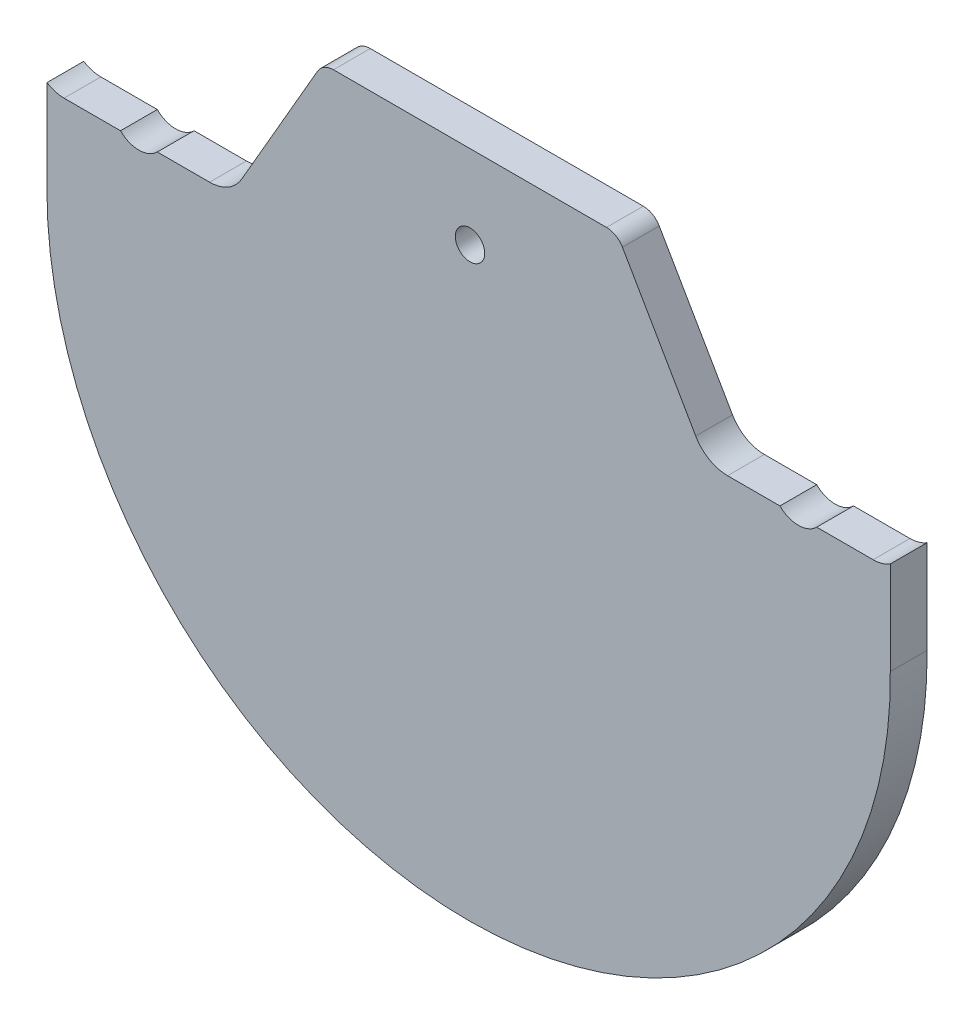
ISO-10303-21;
HEADER;
FILE_DESCRIPTION(('STEP AP214'),'2;1');
FILE_NAME('part.step','',(''),(''),'','','');
FILE_SCHEMA(('AUTOMOTIVE_DESIGN { 1 0 10303 214 1 1 1 1 }'));
ENDSEC;
DATA;
#1=APPLICATION_CONTEXT('core data for automotive mechanical design processes');
#2=APPLICATION_PROTOCOL_DEFINITION('international standard','automotive_design',2000,#1);
#3=PRODUCT_CONTEXT('',#1,'mechanical');
#4=PRODUCT('Part','Part','',(#3));
#5=PRODUCT_RELATED_PRODUCT_CATEGORY('part','',(#4));
#6=PRODUCT_DEFINITION_FORMATION('','',#4);
#7=PRODUCT_DEFINITION_CONTEXT('part definition',#1,'design');
#8=PRODUCT_DEFINITION('design','',#6,#7);
#9=PRODUCT_DEFINITION_SHAPE('','',#8);
#10=(LENGTH_UNIT() NAMED_UNIT(*) SI_UNIT(.MILLI.,.METRE.));
#11=(NAMED_UNIT(*) PLANE_ANGLE_UNIT() SI_UNIT($,.RADIAN.));
#12=(NAMED_UNIT(*) SI_UNIT($,.STERADIAN.) SOLID_ANGLE_UNIT());
#13=UNCERTAINTY_MEASURE_WITH_UNIT(LENGTH_MEASURE(1.E-05),#10,'distance_accuracy_value','');
#14=(GEOMETRIC_REPRESENTATION_CONTEXT(3) GLOBAL_UNCERTAINTY_ASSIGNED_CONTEXT((#13)) GLOBAL_UNIT_ASSIGNED_CONTEXT((#10,
#11,#12)) REPRESENTATION_CONTEXT('',''));
#15=CARTESIAN_POINT('',(0.,0.,0.));
#16=DIRECTION('',(0.,0.,1.));
#17=DIRECTION('',(1.,0.,0.));
#18=AXIS2_PLACEMENT_3D('',#15,#16,#17);
#19=CARTESIAN_POINT('',(38.5566243270259,-2.5,5.));
#20=DIRECTION('',(0.,0.,-1.));
#21=DIRECTION('',(-1.,0.,0.));
#22=AXIS2_PLACEMENT_3D('',#19,#20,#21);
#23=CYLINDRICAL_SURFACE('',#22,2.5);
#24=CARTESIAN_POINT('',(38.5566243270259,-2.5,0.));
#25=DIRECTION('',(0.,0.,1.));
#26=DIRECTION('',(1.,0.,0.));
#27=AXIS2_PLACEMENT_3D('',#24,#25,#26);
#28=CIRCLE('',#27,2.5);
#29=CARTESIAN_POINT('',(40.721687836487,-1.24999999999999,0.));
#30=VERTEX_POINT('',#29);
#31=CARTESIAN_POINT('',(38.5566243270259,0.,0.));
#32=VERTEX_POINT('',#31);
#33=EDGE_CURVE('E189',#30,#32,#28,.T.);
#34=ORIENTED_EDGE('',*,*,#33,.T.);
#35=DIRECTION('',(0.,0.,-1.));
#36=VECTOR('',#35,1.);
#37=CARTESIAN_POINT('',(38.5566243270259,0.,5.));
#38=LINE('',#37,#36);
#39=CARTESIAN_POINT('',(38.5566243270259,0.,5.));
#40=VERTEX_POINT('',#39);
#41=EDGE_CURVE('E11',#40,#32,#38,.T.);
#42=ORIENTED_EDGE('',*,*,#41,.F.);
#43=CARTESIAN_POINT('',(38.5566243270259,-2.5,5.));
#44=DIRECTION('',(0.,0.,1.));
#45=DIRECTION('',(1.,0.,0.));
#46=AXIS2_PLACEMENT_3D('',#43,#44,#45);
#47=CIRCLE('',#46,2.5);
#48=CARTESIAN_POINT('',(40.721687836487,-1.24999999999999,5.));
#49=VERTEX_POINT('',#48);
#50=EDGE_CURVE('E224',#49,#40,#47,.T.);
#51=ORIENTED_EDGE('',*,*,#50,.F.);
#52=DIRECTION('',(0.,0.,-1.));
#53=VECTOR('',#52,1.);
#54=CARTESIAN_POINT('',(40.721687836487,-1.24999999999999,5.));
#55=LINE('',#54,#53);
#56=EDGE_CURVE('E185',#49,#30,#55,.T.);
#57=ORIENTED_EDGE('',*,*,#56,.T.);
#58=EDGE_LOOP('',(#34,#42,#51,#57));
#59=FACE_BOUND('',#58,.T.);
#60=ADVANCED_FACE('F33',(#59),#23,.T.);
#61=CARTESIAN_POINT('',(1.44337567297407,0.,5.));
#62=DIRECTION('',(0.,-1.,0.));
#63=DIRECTION('',(0.,0.,-1.));
#64=AXIS2_PLACEMENT_3D('',#61,#62,#63);
#65=PLANE('',#64);
#66=DIRECTION('',(-1.,0.,0.));
#67=VECTOR('',#66,1.);
#68=CARTESIAN_POINT('',(1.44337567297407,0.,0.));
#69=LINE('',#68,#67);
#70=CARTESIAN_POINT('',(1.44337567297407,0.,0.));
#71=VERTEX_POINT('',#70);
#72=EDGE_CURVE('E192',#32,#71,#69,.T.);
#73=ORIENTED_EDGE('',*,*,#72,.T.);
#74=DIRECTION('',(0.,0.,-1.));
#75=VECTOR('',#74,1.);
#76=CARTESIAN_POINT('',(1.44337567297407,0.,5.));
#77=LINE('',#76,#75);
#78=CARTESIAN_POINT('',(1.44337567297407,0.,5.));
#79=VERTEX_POINT('',#78);
#80=EDGE_CURVE('E41',#79,#71,#77,.T.);
#81=ORIENTED_EDGE('',*,*,#80,.F.);
#82=DIRECTION('',(-1.,0.,0.));
#83=VECTOR('',#82,1.);
#84=CARTESIAN_POINT('',(1.44337567297407,0.,5.));
#85=LINE('',#84,#83);
#86=EDGE_CURVE('E122',#40,#79,#85,.T.);
#87=ORIENTED_EDGE('',*,*,#86,.F.);
#88=ORIENTED_EDGE('',*,*,#41,.T.);
#89=EDGE_LOOP('',(#73,#81,#87,#88));
#90=FACE_BOUND('',#89,.T.);
#91=ADVANCED_FACE('F333',(#90),#65,.F.);
#92=CARTESIAN_POINT('',(1.44337567297406,-2.5,5.));
#93=DIRECTION('',(0.,0.,-1.));
#94=DIRECTION('',(-1.,0.,0.));
#95=AXIS2_PLACEMENT_3D('',#92,#93,#94);
#96=CYLINDRICAL_SURFACE('',#95,2.5);
#97=CARTESIAN_POINT('',(1.44337567297406,-2.5,0.));
#98=DIRECTION('',(0.,0.,1.));
#99=DIRECTION('',(-1.,0.,0.));
#100=AXIS2_PLACEMENT_3D('',#97,#98,#99);
#101=CIRCLE('',#100,2.5);
#102=CARTESIAN_POINT('',(-0.721687836487038,-1.25000000000001,0.));
#103=VERTEX_POINT('',#102);
#104=EDGE_CURVE('E195',#71,#103,#101,.T.);
#105=ORIENTED_EDGE('',*,*,#104,.T.);
#106=DIRECTION('',(0.,0.,-1.));
#107=VECTOR('',#106,1.);
#108=CARTESIAN_POINT('',(-0.721687836487038,-1.25000000000001,5.));
#109=LINE('',#108,#107);
#110=CARTESIAN_POINT('',(-0.721687836487038,-1.25000000000001,5.));
#111=VERTEX_POINT('',#110);
#112=EDGE_CURVE('E261',#111,#103,#109,.T.);
#113=ORIENTED_EDGE('',*,*,#112,.F.);
#114=CARTESIAN_POINT('',(1.44337567297406,-2.5,5.));
#115=DIRECTION('',(0.,0.,1.));
#116=DIRECTION('',(-1.,0.,0.));
#117=AXIS2_PLACEMENT_3D('',#114,#115,#116);
#118=CIRCLE('',#117,2.5);
#119=EDGE_CURVE('E269',#79,#111,#118,.T.);
#120=ORIENTED_EDGE('',*,*,#119,.F.);
#121=ORIENTED_EDGE('',*,*,#80,.T.);
#122=EDGE_LOOP('',(#105,#113,#120,#121));
#123=FACE_BOUND('',#122,.T.);
#124=ADVANCED_FACE('F267',(#123),#96,.T.);
#125=CARTESIAN_POINT('',(-0.721687836487038,-1.25000000000001,5.));
#126=DIRECTION('',(0.866025403784438,-0.500000000000001,0.));
#127=DIRECTION('',(0.500000000000001,0.866025403784438,0.));
#128=AXIS2_PLACEMENT_3D('',#125,#126,#127);
#129=PLANE('',#128);
#130=DIRECTION('',(-0.500000000000001,-0.866025403784438,0.));
#131=VECTOR('',#130,1.);
#132=CARTESIAN_POINT('',(-0.721687836487038,-1.25000000000001,0.));
#133=LINE('',#132,#131);
#134=CARTESIAN_POINT('',(-11.0566243270259,-19.1506350946109,0.));
#135=VERTEX_POINT('',#134);
#136=EDGE_CURVE('E197',#103,#135,#133,.T.);
#137=ORIENTED_EDGE('',*,*,#136,.T.);
#138=DIRECTION('',(0.,0.,-1.));
#139=VECTOR('',#138,1.);
#140=CARTESIAN_POINT('',(-11.0566243270259,-19.1506350946109,5.));
#141=LINE('',#140,#139);
#142=CARTESIAN_POINT('',(-11.0566243270259,-19.1506350946109,5.));
#143=VERTEX_POINT('',#142);
#144=EDGE_CURVE('E258',#143,#135,#141,.T.);
#145=ORIENTED_EDGE('',*,*,#144,.F.);
#146=DIRECTION('',(-0.500000000000001,-0.866025403784438,0.));
#147=VECTOR('',#146,1.);
#148=CARTESIAN_POINT('',(-0.721687836487038,-1.25000000000001,5.));
#149=LINE('',#148,#147);
#150=EDGE_CURVE('E287',#111,#143,#149,.T.);
#151=ORIENTED_EDGE('',*,*,#150,.F.);
#152=ORIENTED_EDGE('',*,*,#112,.T.);
#153=EDGE_LOOP('',(#137,#145,#151,#152));
#154=FACE_BOUND('',#153,.T.);
#155=ADVANCED_FACE('F278',(#154),#129,.F.);
#156=CARTESIAN_POINT('',(-15.3867513459481,-16.650635094611,5.));
#157=DIRECTION('',(0.,0.,-1.));
#158=DIRECTION('',(-1.,0.,0.));
#159=AXIS2_PLACEMENT_3D('',#156,#157,#158);
#160=CYLINDRICAL_SURFACE('',#159,5.);
#161=CARTESIAN_POINT('',(-15.3867513459481,-16.650635094611,0.));
#162=DIRECTION('',(0.,0.,-1.));
#163=DIRECTION('',(1.,0.,0.));
#164=AXIS2_PLACEMENT_3D('',#161,#162,#163);
#165=CIRCLE('',#164,5.);
#166=CARTESIAN_POINT('',(-15.3867513459482,-21.650635094611,0.));
#167=VERTEX_POINT('',#166);
#168=EDGE_CURVE('E199',#135,#167,#165,.T.);
#169=ORIENTED_EDGE('',*,*,#168,.T.);
#170=DIRECTION('',(0.,0.,-1.));
#171=VECTOR('',#170,1.);
#172=CARTESIAN_POINT('',(-15.3867513459482,-21.650635094611,5.));
#173=LINE('',#172,#171);
#174=CARTESIAN_POINT('',(-15.3867513459482,-21.650635094611,5.));
#175=VERTEX_POINT('',#174);
#176=EDGE_CURVE('E255',#175,#167,#173,.T.);
#177=ORIENTED_EDGE('',*,*,#176,.F.);
#178=CARTESIAN_POINT('',(-15.3867513459481,-16.650635094611,5.));
#179=DIRECTION('',(0.,0.,-1.));
#180=DIRECTION('',(1.,0.,0.));
#181=AXIS2_PLACEMENT_3D('',#178,#179,#180);
#182=CIRCLE('',#181,5.);
#183=EDGE_CURVE('E284',#143,#175,#182,.T.);
#184=ORIENTED_EDGE('',*,*,#183,.F.);
#185=ORIENTED_EDGE('',*,*,#144,.T.);
#186=EDGE_LOOP('',(#169,#177,#184,#185));
#187=FACE_BOUND('',#186,.T.);
#188=ADVANCED_FACE('F282',(#187),#160,.F.);
#189=CARTESIAN_POINT('',(-15.3867513459482,-21.650635094611,5.));
#190=DIRECTION('',(0.,-1.,0.));
#191=DIRECTION('',(1.,0.,0.));
#192=AXIS2_PLACEMENT_3D('',#189,#190,#191);
#193=PLANE('',#192);
#194=DIRECTION('',(-1.,0.,0.));
#195=VECTOR('',#194,1.);
#196=CARTESIAN_POINT('',(-15.3867513459482,-21.650635094611,0.));
#197=LINE('',#196,#195);
#198=CARTESIAN_POINT('',(-22.5,-21.650635094611,0.));
#199=VERTEX_POINT('',#198);
#200=EDGE_CURVE('E201',#167,#199,#197,.T.);
#201=ORIENTED_EDGE('',*,*,#200,.T.);
#202=DIRECTION('',(0.,0.,-1.));
#203=VECTOR('',#202,1.);
#204=CARTESIAN_POINT('',(-22.5,-21.650635094611,5.));
#205=LINE('',#204,#203);
#206=CARTESIAN_POINT('',(-22.5,-21.650635094611,5.));
#207=VERTEX_POINT('',#206);
#208=EDGE_CURVE('E252',#207,#199,#205,.T.);
#209=ORIENTED_EDGE('',*,*,#208,.F.);
#210=DIRECTION('',(-1.,0.,0.));
#211=VECTOR('',#210,1.);
#212=CARTESIAN_POINT('',(-15.3867513459482,-21.650635094611,5.));
#213=LINE('',#212,#211);
#214=EDGE_CURVE('E286',#175,#207,#213,.T.);
#215=ORIENTED_EDGE('',*,*,#214,.F.);
#216=ORIENTED_EDGE('',*,*,#176,.T.);
#217=EDGE_LOOP('',(#201,#209,#215,#216));
#218=FACE_BOUND('',#217,.T.);
#219=ADVANCED_FACE('F346',(#218),#193,.F.);
#220=CARTESIAN_POINT('',(-25.,-19.150635094611,5.));
#221=DIRECTION('',(0.,0.,-1.));
#222=DIRECTION('',(-1.,0.,0.));
#223=AXIS2_PLACEMENT_3D('',#220,#221,#222);
#224=CYLINDRICAL_SURFACE('',#223,3.53553390593273);
#225=CARTESIAN_POINT('',(-25.,-19.150635094611,0.));
#226=DIRECTION('',(0.,0.,-1.));
#227=DIRECTION('',(1.,0.,0.));
#228=AXIS2_PLACEMENT_3D('',#225,#226,#227);
#229=CIRCLE('',#228,3.53553390593273);
#230=CARTESIAN_POINT('',(-27.5,-21.650635094611,0.));
#231=VERTEX_POINT('',#230);
#232=EDGE_CURVE('E203',#199,#231,#229,.T.);
#233=ORIENTED_EDGE('',*,*,#232,.T.);
#234=DIRECTION('',(0.,0.,-1.));
#235=VECTOR('',#234,1.);
#236=CARTESIAN_POINT('',(-27.5,-21.650635094611,5.));
#237=LINE('',#236,#235);
#238=CARTESIAN_POINT('',(-27.5,-21.650635094611,5.));
#239=VERTEX_POINT('',#238);
#240=EDGE_CURVE('E249',#239,#231,#237,.T.);
#241=ORIENTED_EDGE('',*,*,#240,.F.);
#242=CARTESIAN_POINT('',(-25.,-19.150635094611,5.));
#243=DIRECTION('',(0.,0.,-1.));
#244=DIRECTION('',(1.,0.,0.));
#245=AXIS2_PLACEMENT_3D('',#242,#243,#244);
#246=CIRCLE('',#245,3.53553390593273);
#247=EDGE_CURVE('E289',#207,#239,#246,.T.);
#248=ORIENTED_EDGE('',*,*,#247,.F.);
#249=ORIENTED_EDGE('',*,*,#208,.T.);
#250=EDGE_LOOP('',(#233,#241,#248,#249));
#251=FACE_BOUND('',#250,.T.);
#252=ADVANCED_FACE('F349',(#251),#224,.F.);
#253=CARTESIAN_POINT('',(-27.5,-21.650635094611,5.));
#254=DIRECTION('',(0.,-1.,0.));
#255=DIRECTION('',(1.,0.,0.));
#256=AXIS2_PLACEMENT_3D('',#253,#254,#255);
#257=PLANE('',#256);
#258=DIRECTION('',(-1.,0.,0.));
#259=VECTOR('',#258,1.);
#260=CARTESIAN_POINT('',(-27.5,-21.650635094611,0.));
#261=LINE('',#260,#259);
#262=CARTESIAN_POINT('',(-35.17,-21.650635094611,0.));
#263=VERTEX_POINT('',#262);
#264=EDGE_CURVE('E205',#231,#263,#261,.T.);
#265=ORIENTED_EDGE('',*,*,#264,.T.);
#266=DIRECTION('',(0.,0.,-1.));
#267=VECTOR('',#266,1.);
#268=CARTESIAN_POINT('',(-35.17,-21.650635094611,5.));
#269=LINE('',#268,#267);
#270=CARTESIAN_POINT('',(-35.17,-21.650635094611,5.));
#271=VERTEX_POINT('',#270);
#272=EDGE_CURVE('E246',#271,#263,#269,.T.);
#273=ORIENTED_EDGE('',*,*,#272,.F.);
#274=DIRECTION('',(-1.,0.,0.));
#275=VECTOR('',#274,1.);
#276=CARTESIAN_POINT('',(-27.5,-21.650635094611,5.));
#277=LINE('',#276,#275);
#278=EDGE_CURVE('E295',#239,#271,#277,.T.);
#279=ORIENTED_EDGE('',*,*,#278,.F.);
#280=ORIENTED_EDGE('',*,*,#240,.T.);
#281=EDGE_LOOP('',(#265,#273,#279,#280));
#282=FACE_BOUND('',#281,.T.);
#283=ADVANCED_FACE('F353',(#282),#257,.F.);
#284=CARTESIAN_POINT('',(-35.17,-17.260635094611,5.));
#285=DIRECTION('',(0.,0.,-1.));
#286=DIRECTION('',(-1.,0.,0.));
#287=AXIS2_PLACEMENT_3D('',#284,#285,#286);
#288=CYLINDRICAL_SURFACE('',#287,4.39);
#289=CARTESIAN_POINT('',(-35.17,-17.260635094611,0.));
#290=DIRECTION('',(0.,0.,-1.));
#291=DIRECTION('',(-1.,0.,0.));
#292=AXIS2_PLACEMENT_3D('',#289,#290,#291);
#293=CIRCLE('',#292,4.39);
#294=CARTESIAN_POINT('',(-37.5010298153392,-20.980635094611,0.));
#295=VERTEX_POINT('',#294);
#296=EDGE_CURVE('E207',#263,#295,#293,.T.);
#297=ORIENTED_EDGE('',*,*,#296,.T.);
#298=DIRECTION('',(0.,0.,-1.));
#299=VECTOR('',#298,1.);
#300=CARTESIAN_POINT('',(-37.5010298153392,-20.980635094611,5.));
#301=LINE('',#300,#299);
#302=CARTESIAN_POINT('',(-37.5010298153392,-20.980635094611,5.));
#303=VERTEX_POINT('',#302);
#304=EDGE_CURVE('E243',#303,#295,#301,.T.);
#305=ORIENTED_EDGE('',*,*,#304,.F.);
#306=CARTESIAN_POINT('',(-35.17,-17.260635094611,5.));
#307=DIRECTION('',(0.,0.,-1.));
#308=DIRECTION('',(-1.,0.,0.));
#309=AXIS2_PLACEMENT_3D('',#306,#307,#308);
#310=CIRCLE('',#309,4.39);
#311=EDGE_CURVE('E297',#271,#303,#310,.T.);
#312=ORIENTED_EDGE('',*,*,#311,.F.);
#313=ORIENTED_EDGE('',*,*,#272,.T.);
#314=EDGE_LOOP('',(#297,#305,#312,#313));
#315=FACE_BOUND('',#314,.T.);
#316=ADVANCED_FACE('F357',(#315),#288,.F.);
#317=CARTESIAN_POINT('',(-37.5010298153392,-20.980635094611,5.));
#318=DIRECTION('',(0.999999996696795,8.12798212897668E-05,0.));
#319=DIRECTION('',(-8.12798212897668E-05,0.999999996696796,0.));
#320=AXIS2_PLACEMENT_3D('',#317,#318,#319);
#321=PLANE('',#320);
#322=DIRECTION('',(8.12798212897668E-05,-0.999999996696795,0.));
#323=VECTOR('',#322,1.);
#324=CARTESIAN_POINT('',(-37.5010298153392,-20.980635094611,0.));
#325=LINE('',#324,#323);
#326=CARTESIAN_POINT('',(-37.5,-33.6506350946109,0.));
#327=VERTEX_POINT('',#326);
#328=EDGE_CURVE('E209',#295,#327,#325,.T.);
#329=ORIENTED_EDGE('',*,*,#328,.T.);
#330=DIRECTION('',(0.,0.,-1.));
#331=VECTOR('',#330,1.);
#332=CARTESIAN_POINT('',(-37.5,-33.6506350946109,5.));
#333=LINE('',#332,#331);
#334=CARTESIAN_POINT('',(-37.5,-33.6506350946109,5.));
#335=VERTEX_POINT('',#334);
#336=EDGE_CURVE('E240',#335,#327,#333,.T.);
#337=ORIENTED_EDGE('',*,*,#336,.F.);
#338=DIRECTION('',(8.12798212897668E-05,-0.999999996696795,0.));
#339=VECTOR('',#338,1.);
#340=CARTESIAN_POINT('',(-37.5010298153392,-20.980635094611,5.));
#341=LINE('',#340,#339);
#342=EDGE_CURVE('E299',#303,#335,#341,.T.);
#343=ORIENTED_EDGE('',*,*,#342,.F.);
#344=ORIENTED_EDGE('',*,*,#304,.T.);
#345=EDGE_LOOP('',(#329,#337,#343,#344));
#346=FACE_BOUND('',#345,.T.);
#347=ADVANCED_FACE('F361',(#346),#321,.F.);
#348=CARTESIAN_POINT('',(19.8136154572361,-33.6506350946059,5.));
#349=DIRECTION('',(0.,0.,-1.));
#350=DIRECTION('',(-1.,0.,0.));
#351=AXIS2_PLACEMENT_3D('',#348,#349,#350);
#352=CYLINDRICAL_SURFACE('',#351,57.3136154572361);
#353=CARTESIAN_POINT('',(19.8136154572361,-33.6506350946059,0.));
#354=DIRECTION('',(0.,0.,1.));
#355=DIRECTION('',(1.,0.,0.));
#356=AXIS2_PLACEMENT_3D('',#353,#354,#355);
#357=CIRCLE('',#356,57.3136154572361);
#358=CARTESIAN_POINT('',(77.1235213039054,-32.9985548650052,0.));
#359=VERTEX_POINT('',#358);
#360=EDGE_CURVE('E211',#327,#359,#357,.T.);
#361=ORIENTED_EDGE('',*,*,#360,.T.);
#362=DIRECTION('',(0.,0.,-1.));
#363=VECTOR('',#362,1.);
#364=CARTESIAN_POINT('',(77.1235213039054,-32.9985548650052,5.));
#365=LINE('',#364,#363);
#366=CARTESIAN_POINT('',(77.1235213039054,-32.9985548650052,5.));
#367=VERTEX_POINT('',#366);
#368=EDGE_CURVE('E237',#367,#359,#365,.T.);
#369=ORIENTED_EDGE('',*,*,#368,.F.);
#370=CARTESIAN_POINT('',(19.8136154572361,-33.6506350946059,5.));
#371=DIRECTION('',(0.,0.,1.));
#372=DIRECTION('',(1.,0.,0.));
#373=AXIS2_PLACEMENT_3D('',#370,#371,#372);
#374=CIRCLE('',#373,57.3136154572361);
#375=EDGE_CURVE('E301',#335,#367,#374,.T.);
#376=ORIENTED_EDGE('',*,*,#375,.F.);
#377=ORIENTED_EDGE('',*,*,#336,.T.);
#378=EDGE_LOOP('',(#361,#369,#376,#377));
#379=FACE_BOUND('',#378,.T.);
#380=ADVANCED_FACE('F365',(#379),#352,.T.);
#381=CARTESIAN_POINT('',(77.1235213039054,-20.3286818839299,5.));
#382=DIRECTION('',(-1.,0.,0.));
#383=DIRECTION('',(0.,0.,1.));
#384=AXIS2_PLACEMENT_3D('',#381,#382,#383);
#385=PLANE('',#384);
#386=DIRECTION('',(0.,1.,0.));
#387=VECTOR('',#386,1.);
#388=CARTESIAN_POINT('',(77.1235213039054,-20.3286818839299,0.));
#389=LINE('',#388,#387);
#390=CARTESIAN_POINT('',(77.1235213039054,-20.3286818839299,0.));
#391=VERTEX_POINT('',#390);
#392=EDGE_CURVE('E213',#359,#391,#389,.T.);
#393=ORIENTED_EDGE('',*,*,#392,.T.);
#394=DIRECTION('',(0.,0.,-1.));
#395=VECTOR('',#394,1.);
#396=CARTESIAN_POINT('',(77.1235213039054,-20.3286818839299,5.));
#397=LINE('',#396,#395);
#398=CARTESIAN_POINT('',(77.1235213039054,-20.3286818839299,5.));
#399=VERTEX_POINT('',#398);
#400=EDGE_CURVE('E234',#399,#391,#397,.T.);
#401=ORIENTED_EDGE('',*,*,#400,.F.);
#402=DIRECTION('',(0.,1.,0.));
#403=VECTOR('',#402,1.);
#404=CARTESIAN_POINT('',(77.1235213039054,-20.3286818839299,5.));
#405=LINE('',#404,#403);
#406=EDGE_CURVE('E303',#367,#399,#405,.T.);
#407=ORIENTED_EDGE('',*,*,#406,.F.);
#408=ORIENTED_EDGE('',*,*,#368,.T.);
#409=EDGE_LOOP('',(#393,#401,#407,#408));
#410=FACE_BOUND('',#409,.T.);
#411=ADVANCED_FACE('F369',(#410),#385,.F.);
#412=CARTESIAN_POINT('',(74.793302349434,-16.6106706297777,5.));
#413=DIRECTION('',(0.,0.,-1.));
#414=DIRECTION('',(-1.,0.,0.));
#415=AXIS2_PLACEMENT_3D('',#412,#413,#414);
#416=CYLINDRICAL_SURFACE('',#415,4.38788423523001);
#417=CARTESIAN_POINT('',(74.793302349434,-16.6106706297777,0.));
#418=DIRECTION('',(0.,0.,-1.));
#419=DIRECTION('',(1.,0.,0.));
#420=AXIS2_PLACEMENT_3D('',#417,#418,#419);
#421=CIRCLE('',#420,4.38788423523001);
#422=CARTESIAN_POINT('',(74.793302349434,-20.9985548650077,0.));
#423=VERTEX_POINT('',#422);
#424=EDGE_CURVE('E215',#391,#423,#421,.T.);
#425=ORIENTED_EDGE('',*,*,#424,.T.);
#426=DIRECTION('',(0.,0.,-1.));
#427=VECTOR('',#426,1.);
#428=CARTESIAN_POINT('',(74.793302349434,-20.9985548650077,5.));
#429=LINE('',#428,#427);
#430=CARTESIAN_POINT('',(74.793302349434,-20.9985548650077,5.));
#431=VERTEX_POINT('',#430);
#432=EDGE_CURVE('E231',#431,#423,#429,.T.);
#433=ORIENTED_EDGE('',*,*,#432,.F.);
#434=CARTESIAN_POINT('',(74.793302349434,-16.6106706297777,5.));
#435=DIRECTION('',(0.,0.,-1.));
#436=DIRECTION('',(1.,0.,0.));
#437=AXIS2_PLACEMENT_3D('',#434,#435,#436);
#438=CIRCLE('',#437,4.38788423523001);
#439=EDGE_CURVE('E305',#399,#431,#438,.T.);
#440=ORIENTED_EDGE('',*,*,#439,.F.);
#441=ORIENTED_EDGE('',*,*,#400,.T.);
#442=EDGE_LOOP('',(#425,#433,#440,#441));
#443=FACE_BOUND('',#442,.T.);
#444=ADVANCED_FACE('F373',(#443),#416,.F.);
#445=CARTESIAN_POINT('',(67.1235213039053,-20.9985548650077,5.));
#446=DIRECTION('',(0.,-1.,0.));
#447=DIRECTION('',(1.,0.,0.));
#448=AXIS2_PLACEMENT_3D('',#445,#446,#447);
#449=PLANE('',#448);
#450=DIRECTION('',(-1.,0.,0.));
#451=VECTOR('',#450,1.);
#452=CARTESIAN_POINT('',(67.1235213039053,-20.9985548650077,0.));
#453=LINE('',#452,#451);
#454=CARTESIAN_POINT('',(67.1235213039053,-20.9985548650077,0.));
#455=VERTEX_POINT('',#454);
#456=EDGE_CURVE('E217',#423,#455,#453,.T.);
#457=ORIENTED_EDGE('',*,*,#456,.T.);
#458=DIRECTION('',(0.,0.,-1.));
#459=VECTOR('',#458,1.);
#460=CARTESIAN_POINT('',(67.1235213039053,-20.9985548650077,5.));
#461=LINE('',#460,#459);
#462=CARTESIAN_POINT('',(67.1235213039053,-20.9985548650077,5.));
#463=VERTEX_POINT('',#462);
#464=EDGE_CURVE('E228',#463,#455,#461,.T.);
#465=ORIENTED_EDGE('',*,*,#464,.F.);
#466=DIRECTION('',(-1.,0.,0.));
#467=VECTOR('',#466,1.);
#468=CARTESIAN_POINT('',(67.1235213039053,-20.9985548650077,5.));
#469=LINE('',#468,#467);
#470=EDGE_CURVE('E307',#431,#463,#469,.T.);
#471=ORIENTED_EDGE('',*,*,#470,.F.);
#472=ORIENTED_EDGE('',*,*,#432,.T.);
#473=EDGE_LOOP('',(#457,#465,#471,#472));
#474=FACE_BOUND('',#473,.T.);
#475=ADVANCED_FACE('F313',(#474),#449,.F.);
#476=CARTESIAN_POINT('',(64.6235213039054,-18.4985548650072,5.));
#477=DIRECTION('',(0.,0.,-1.));
#478=DIRECTION('',(-1.,0.,0.));
#479=AXIS2_PLACEMENT_3D('',#476,#477,#478);
#480=CYLINDRICAL_SURFACE('',#479,3.53553390593311);
#481=CARTESIAN_POINT('',(64.6235213039054,-18.4985548650072,0.));
#482=DIRECTION('',(0.,0.,-1.));
#483=DIRECTION('',(-1.,0.,0.));
#484=AXIS2_PLACEMENT_3D('',#481,#482,#483);
#485=CIRCLE('',#484,3.53553390593311);
#486=CARTESIAN_POINT('',(62.1235213039054,-20.9985548650077,0.));
#487=VERTEX_POINT('',#486);
#488=EDGE_CURVE('E219',#455,#487,#485,.T.);
#489=ORIENTED_EDGE('',*,*,#488,.T.);
#490=DIRECTION('',(0.,0.,-1.));
#491=VECTOR('',#490,1.);
#492=CARTESIAN_POINT('',(62.1235213039054,-20.9985548650077,5.));
#493=LINE('',#492,#491);
#494=CARTESIAN_POINT('',(62.1235213039054,-20.9985548650077,5.));
#495=VERTEX_POINT('',#494);
#496=EDGE_CURVE('E180',#495,#487,#493,.T.);
#497=ORIENTED_EDGE('',*,*,#496,.F.);
#498=CARTESIAN_POINT('',(64.6235213039054,-18.4985548650072,5.));
#499=DIRECTION('',(0.,0.,-1.));
#500=DIRECTION('',(-1.,0.,0.));
#501=AXIS2_PLACEMENT_3D('',#498,#499,#500);
#502=CIRCLE('',#501,3.53553390593311);
#503=EDGE_CURVE('E171',#463,#495,#502,.T.);
#504=ORIENTED_EDGE('',*,*,#503,.F.);
#505=ORIENTED_EDGE('',*,*,#464,.T.);
#506=EDGE_LOOP('',(#489,#497,#504,#505));
#507=FACE_BOUND('',#506,.T.);
#508=ADVANCED_FACE('F317',(#507),#480,.F.);
#509=CARTESIAN_POINT('',(55.0102726498535,-20.9985548650077,5.));
#510=DIRECTION('',(0.,-1.,0.));
#511=DIRECTION('',(0.,0.,-1.));
#512=AXIS2_PLACEMENT_3D('',#509,#510,#511);
#513=PLANE('',#512);
#514=DIRECTION('',(-1.,0.,0.));
#515=VECTOR('',#514,1.);
#516=CARTESIAN_POINT('',(55.0102726498535,-20.9985548650077,0.));
#517=LINE('',#516,#515);
#518=CARTESIAN_POINT('',(55.0102726498535,-20.9985548650077,0.));
#519=VERTEX_POINT('',#518);
#520=EDGE_CURVE('E179',#487,#519,#517,.T.);
#521=ORIENTED_EDGE('',*,*,#520,.T.);
#522=DIRECTION('',(0.,0.,-1.));
#523=VECTOR('',#522,1.);
#524=CARTESIAN_POINT('',(55.0102726498535,-20.9985548650077,5.));
#525=LINE('',#524,#523);
#526=CARTESIAN_POINT('',(55.0102726498535,-20.9985548650077,5.));
#527=VERTEX_POINT('',#526);
#528=EDGE_CURVE('E176',#527,#519,#525,.T.);
#529=ORIENTED_EDGE('',*,*,#528,.F.);
#530=DIRECTION('',(-1.,0.,0.));
#531=VECTOR('',#530,1.);
#532=CARTESIAN_POINT('',(55.0102726498535,-20.9985548650077,5.));
#533=LINE('',#532,#531);
#534=EDGE_CURVE('E165',#495,#527,#533,.T.);
#535=ORIENTED_EDGE('',*,*,#534,.F.);
#536=ORIENTED_EDGE('',*,*,#496,.T.);
#537=EDGE_LOOP('',(#521,#529,#535,#536));
#538=FACE_BOUND('',#537,.T.);
#539=ADVANCED_FACE('F177',(#538),#513,.F.);
#540=CARTESIAN_POINT('',(55.0102726498535,-15.9985548650077,5.));
#541=DIRECTION('',(0.,0.,-1.));
#542=DIRECTION('',(-1.,0.,0.));
#543=AXIS2_PLACEMENT_3D('',#540,#541,#542);
#544=CYLINDRICAL_SURFACE('',#543,5.);
#545=CARTESIAN_POINT('',(55.0102726498535,-15.9985548650077,0.));
#546=DIRECTION('',(0.,0.,-1.));
#547=DIRECTION('',(-1.,0.,0.));
#548=AXIS2_PLACEMENT_3D('',#545,#546,#547);
#549=CIRCLE('',#548,5.);
#550=CARTESIAN_POINT('',(50.6801456309313,-18.4985548650077,0.));
#551=VERTEX_POINT('',#550);
#552=EDGE_CURVE('E108',#519,#551,#549,.T.);
#553=ORIENTED_EDGE('',*,*,#552,.T.);
#554=DIRECTION('',(0.,0.,-1.));
#555=VECTOR('',#554,1.);
#556=CARTESIAN_POINT('',(50.6801456309313,-18.4985548650077,5.));
#557=LINE('',#556,#555);
#558=CARTESIAN_POINT('',(50.6801456309313,-18.4985548650077,5.));
#559=VERTEX_POINT('',#558);
#560=EDGE_CURVE('E181',#559,#551,#557,.T.);
#561=ORIENTED_EDGE('',*,*,#560,.F.);
#562=CARTESIAN_POINT('',(55.0102726498535,-15.9985548650077,5.));
#563=DIRECTION('',(0.,0.,-1.));
#564=DIRECTION('',(-1.,0.,0.));
#565=AXIS2_PLACEMENT_3D('',#562,#563,#564);
#566=CIRCLE('',#565,5.);
#567=EDGE_CURVE('E169',#527,#559,#566,.T.);
#568=ORIENTED_EDGE('',*,*,#567,.F.);
#569=ORIENTED_EDGE('',*,*,#528,.T.);
#570=EDGE_LOOP('',(#553,#561,#568,#569));
#571=FACE_BOUND('',#570,.T.);
#572=ADVANCED_FACE('F183',(#571),#544,.F.);
#573=CARTESIAN_POINT('',(40.721687836487,-1.24999999999999,5.));
#574=DIRECTION('',(-0.866025403784438,-0.500000000000001,0.));
#575=DIRECTION('',(0.500000000000001,-0.866025403784438,0.));
#576=AXIS2_PLACEMENT_3D('',#573,#574,#575);
#577=PLANE('',#576);
#578=DIRECTION('',(-0.500000000000001,0.866025403784438,0.));
#579=VECTOR('',#578,1.);
#580=CARTESIAN_POINT('',(40.721687836487,-1.24999999999999,0.));
#581=LINE('',#580,#579);
#582=EDGE_CURVE('E114',#551,#30,#581,.T.);
#583=ORIENTED_EDGE('',*,*,#582,.T.);
#584=ORIENTED_EDGE('',*,*,#56,.F.);
#585=DIRECTION('',(-0.500000000000001,0.866025403784438,0.));
#586=VECTOR('',#585,1.);
#587=CARTESIAN_POINT('',(40.721687836487,-1.24999999999999,5.));
#588=LINE('',#587,#586);
#589=EDGE_CURVE('E49',#559,#49,#588,.T.);
#590=ORIENTED_EDGE('',*,*,#589,.F.);
#591=ORIENTED_EDGE('',*,*,#560,.T.);
#592=EDGE_LOOP('',(#583,#584,#590,#591));
#593=FACE_BOUND('',#592,.T.);
#594=ADVANCED_FACE('F321',(#593),#577,.F.);
#595=CARTESIAN_POINT('',(38.5566243270259,-2.5,5.));
#596=DIRECTION('',(0.,0.,1.));
#597=DIRECTION('',(1.,0.,0.));
#598=AXIS2_PLACEMENT_3D('',#595,#596,#597);
#599=PLANE('',#598);
#600=CARTESIAN_POINT('',(20.,-11.3301041492055,5.));
#601=DIRECTION('',(0.,0.,1.));
#602=DIRECTION('',(1.,0.,0.));
#603=AXIS2_PLACEMENT_3D('',#600,#601,#602);
#604=CIRCLE('',#603,1.99999999999999);
#605=CARTESIAN_POINT('',(22.,-11.3301041492055,5.));
#606=VERTEX_POINT('',#605);
#607=EDGE_CURVE('E428',#606,#606,#604,.T.);
#608=ORIENTED_EDGE('',*,*,#607,.F.);
#609=EDGE_LOOP('',(#608));
#610=FACE_BOUND('',#609,.T.);
#611=ORIENTED_EDGE('',*,*,#50,.T.);
#612=ORIENTED_EDGE('',*,*,#86,.T.);
#613=ORIENTED_EDGE('',*,*,#119,.T.);
#614=ORIENTED_EDGE('',*,*,#150,.T.);
#615=ORIENTED_EDGE('',*,*,#183,.T.);
#616=ORIENTED_EDGE('',*,*,#214,.T.);
#617=ORIENTED_EDGE('',*,*,#247,.T.);
#618=ORIENTED_EDGE('',*,*,#278,.T.);
#619=ORIENTED_EDGE('',*,*,#311,.T.);
#620=ORIENTED_EDGE('',*,*,#342,.T.);
#621=ORIENTED_EDGE('',*,*,#375,.T.);
#622=ORIENTED_EDGE('',*,*,#406,.T.);
#623=ORIENTED_EDGE('',*,*,#439,.T.);
#624=ORIENTED_EDGE('',*,*,#470,.T.);
#625=ORIENTED_EDGE('',*,*,#503,.T.);
#626=ORIENTED_EDGE('',*,*,#534,.T.);
#627=ORIENTED_EDGE('',*,*,#567,.T.);
#628=ORIENTED_EDGE('',*,*,#589,.T.);
#629=EDGE_LOOP('',(#611,#612,#613,#614,#615,#616,#617,#618,#619,#620,#621,#622,#623,#624,#625,
#626,#627,#628));
#630=FACE_BOUND('',#629,.T.);
#631=ADVANCED_FACE('F167',(#610,#630),#599,.T.);
#632=CARTESIAN_POINT('',(38.5566243270259,-2.5,0.));
#633=DIRECTION('',(0.,0.,1.));
#634=DIRECTION('',(1.,0.,0.));
#635=AXIS2_PLACEMENT_3D('',#632,#633,#634);
#636=PLANE('',#635);
#637=CARTESIAN_POINT('',(20.,-11.3301041492055,0.));
#638=DIRECTION('',(0.,0.,1.));
#639=DIRECTION('',(1.,0.,0.));
#640=AXIS2_PLACEMENT_3D('',#637,#638,#639);
#641=CIRCLE('',#640,1.99999999999999);
#642=CARTESIAN_POINT('',(22.,-11.3301041492055,0.));
#643=VERTEX_POINT('',#642);
#644=EDGE_CURVE('E193',#643,#643,#641,.T.);
#645=ORIENTED_EDGE('',*,*,#644,.T.);
#646=EDGE_LOOP('',(#645));
#647=FACE_BOUND('',#646,.T.);
#648=ORIENTED_EDGE('',*,*,#33,.F.);
#649=ORIENTED_EDGE('',*,*,#582,.F.);
#650=ORIENTED_EDGE('',*,*,#552,.F.);
#651=ORIENTED_EDGE('',*,*,#520,.F.);
#652=ORIENTED_EDGE('',*,*,#488,.F.);
#653=ORIENTED_EDGE('',*,*,#456,.F.);
#654=ORIENTED_EDGE('',*,*,#424,.F.);
#655=ORIENTED_EDGE('',*,*,#392,.F.);
#656=ORIENTED_EDGE('',*,*,#360,.F.);
#657=ORIENTED_EDGE('',*,*,#328,.F.);
#658=ORIENTED_EDGE('',*,*,#296,.F.);
#659=ORIENTED_EDGE('',*,*,#264,.F.);
#660=ORIENTED_EDGE('',*,*,#232,.F.);
#661=ORIENTED_EDGE('',*,*,#200,.F.);
#662=ORIENTED_EDGE('',*,*,#168,.F.);
#663=ORIENTED_EDGE('',*,*,#136,.F.);
#664=ORIENTED_EDGE('',*,*,#104,.F.);
#665=ORIENTED_EDGE('',*,*,#72,.F.);
#666=EDGE_LOOP('',(#648,#649,#650,#651,#652,#653,#654,#655,#656,#657,#658,#659,#660,#661,#662,
#663,#664,#665));
#667=FACE_BOUND('',#666,.T.);
#668=ADVANCED_FACE('F273',(#647,#667),#636,.F.);
#669=CARTESIAN_POINT('',(20.,-11.3301041492055,5.));
#670=DIRECTION('',(0.,0.,1.));
#671=DIRECTION('',(1.,0.,0.));
#672=AXIS2_PLACEMENT_3D('',#669,#670,#671);
#673=CYLINDRICAL_SURFACE('',#672,1.99999999999999);
#674=ORIENTED_EDGE('',*,*,#644,.F.);
#675=EDGE_LOOP('',(#674));
#676=FACE_BOUND('',#675,.T.);
#677=ORIENTED_EDGE('',*,*,#607,.T.);
#678=EDGE_LOOP('',(#677));
#679=FACE_BOUND('',#678,.T.);
#680=ADVANCED_FACE('F410',(#676,#679),#673,.F.);
#681=CLOSED_SHELL('',(#60,#91,#124,#155,#188,#219,#252,#283,#316,#347,#380,#411,#444,#475,#508,
#539,#572,#594,#631,#668,#680));
#682=MANIFOLD_SOLID_BREP('B2',#681);
#683=ADVANCED_BREP_SHAPE_REPRESENTATION('',(#18,#682),#14);
#684=SHAPE_DEFINITION_REPRESENTATION(#9,#683);
ENDSEC;
END-ISO-10303-21;
